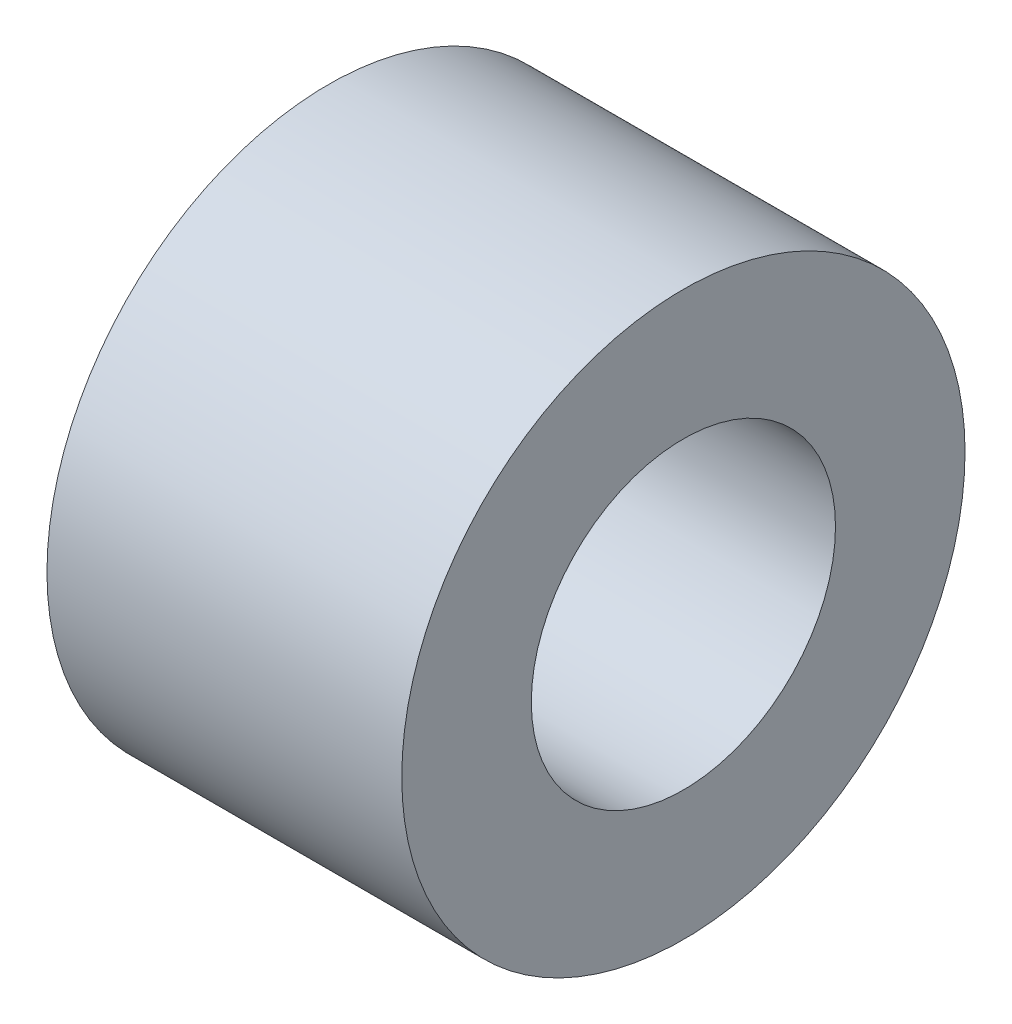
ISO-10303-21;
HEADER;
FILE_DESCRIPTION(('STEP AP214'),'2;1');
FILE_NAME('part.step','',(''),(''),'','','');
FILE_SCHEMA(('AUTOMOTIVE_DESIGN { 1 0 10303 214 1 1 1 1 }'));
ENDSEC;
DATA;
#1=APPLICATION_CONTEXT('core data for automotive mechanical design processes');
#2=APPLICATION_PROTOCOL_DEFINITION('international standard','automotive_design',2000,#1);
#3=PRODUCT_CONTEXT('',#1,'mechanical');
#4=PRODUCT('Part','Part','',(#3));
#5=PRODUCT_RELATED_PRODUCT_CATEGORY('part','',(#4));
#6=PRODUCT_DEFINITION_FORMATION('','',#4);
#7=PRODUCT_DEFINITION_CONTEXT('part definition',#1,'design');
#8=PRODUCT_DEFINITION('design','',#6,#7);
#9=PRODUCT_DEFINITION_SHAPE('','',#8);
#10=(LENGTH_UNIT() NAMED_UNIT(*) SI_UNIT(.MILLI.,.METRE.));
#11=(NAMED_UNIT(*) PLANE_ANGLE_UNIT() SI_UNIT($,.RADIAN.));
#12=(NAMED_UNIT(*) SI_UNIT($,.STERADIAN.) SOLID_ANGLE_UNIT());
#13=UNCERTAINTY_MEASURE_WITH_UNIT(LENGTH_MEASURE(1.E-05),#10,'distance_accuracy_value','');
#14=(GEOMETRIC_REPRESENTATION_CONTEXT(3) GLOBAL_UNCERTAINTY_ASSIGNED_CONTEXT((#13)) GLOBAL_UNIT_ASSIGNED_CONTEXT((#10,
#11,#12)) REPRESENTATION_CONTEXT('',''));
#15=CARTESIAN_POINT('',(0.,0.,0.));
#16=DIRECTION('',(0.,0.,1.));
#17=DIRECTION('',(1.,0.,0.));
#18=AXIS2_PLACEMENT_3D('',#15,#16,#17);
#19=CARTESIAN_POINT('',(-8.,0.,0.));
#20=DIRECTION('',(1.,0.,0.));
#21=DIRECTION('',(0.,0.,-1.));
#22=AXIS2_PLACEMENT_3D('',#19,#20,#21);
#23=CYLINDRICAL_SURFACE('',#22,6.35);
#24=CARTESIAN_POINT('',(-8.,0.,0.));
#25=DIRECTION('',(1.,0.,0.));
#26=DIRECTION('',(0.,0.,-1.));
#27=AXIS2_PLACEMENT_3D('',#24,#25,#26);
#28=CIRCLE('',#27,6.35);
#29=CARTESIAN_POINT('',(-8.,0.,-6.35));
#30=VERTEX_POINT('',#29);
#31=EDGE_CURVE('E10',#30,#30,#28,.T.);
#32=ORIENTED_EDGE('',*,*,#31,.T.);
#33=EDGE_LOOP('',(#32));
#34=FACE_BOUND('',#33,.T.);
#35=CARTESIAN_POINT('',(0.,0.,0.));
#36=DIRECTION('',(1.,0.,0.));
#37=DIRECTION('',(0.,0.,-1.));
#38=AXIS2_PLACEMENT_3D('',#35,#36,#37);
#39=CIRCLE('',#38,6.35);
#40=CARTESIAN_POINT('',(0.,0.,-6.35));
#41=VERTEX_POINT('',#40);
#42=EDGE_CURVE('E34',#41,#41,#39,.T.);
#43=ORIENTED_EDGE('',*,*,#42,.F.);
#44=EDGE_LOOP('',(#43));
#45=FACE_BOUND('',#44,.T.);
#46=ADVANCED_FACE('F31',(#34,#45),#23,.T.);
#47=CARTESIAN_POINT('',(-8.,0.,0.));
#48=DIRECTION('',(1.,0.,0.));
#49=DIRECTION('',(0.,0.,-1.));
#50=AXIS2_PLACEMENT_3D('',#47,#48,#49);
#51=PLANE('',#50);
#52=CARTESIAN_POINT('',(-8.,0.,0.));
#53=DIRECTION('',(1.,0.,0.));
#54=DIRECTION('',(0.,0.,-1.));
#55=AXIS2_PLACEMENT_3D('',#52,#53,#54);
#56=CIRCLE('',#55,3.429);
#57=CARTESIAN_POINT('',(-8.,0.,-3.429));
#58=VERTEX_POINT('',#57);
#59=EDGE_CURVE('E41',#58,#58,#56,.T.);
#60=ORIENTED_EDGE('',*,*,#59,.T.);
#61=EDGE_LOOP('',(#60));
#62=FACE_BOUND('',#61,.T.);
#63=ORIENTED_EDGE('',*,*,#31,.F.);
#64=EDGE_LOOP('',(#63));
#65=FACE_BOUND('',#64,.T.);
#66=ADVANCED_FACE('F49',(#62,#65),#51,.F.);
#67=CARTESIAN_POINT('',(0.,0.,0.));
#68=DIRECTION('',(1.,0.,0.));
#69=DIRECTION('',(0.,0.,-1.));
#70=AXIS2_PLACEMENT_3D('',#67,#68,#69);
#71=PLANE('',#70);
#72=CARTESIAN_POINT('',(0.,0.,0.));
#73=DIRECTION('',(1.,0.,0.));
#74=DIRECTION('',(0.,0.,-1.));
#75=AXIS2_PLACEMENT_3D('',#72,#73,#74);
#76=CIRCLE('',#75,3.429);
#77=CARTESIAN_POINT('',(0.,0.,-3.429));
#78=VERTEX_POINT('',#77);
#79=EDGE_CURVE('E43',#78,#78,#76,.T.);
#80=ORIENTED_EDGE('',*,*,#79,.F.);
#81=EDGE_LOOP('',(#80));
#82=FACE_BOUND('',#81,.T.);
#83=ORIENTED_EDGE('',*,*,#42,.T.);
#84=EDGE_LOOP('',(#83));
#85=FACE_BOUND('',#84,.T.);
#86=ADVANCED_FACE('F55',(#82,#85),#71,.T.);
#87=CARTESIAN_POINT('',(-8.,0.,0.));
#88=DIRECTION('',(1.,0.,0.));
#89=DIRECTION('',(0.,0.,-1.));
#90=AXIS2_PLACEMENT_3D('',#87,#88,#89);
#91=CYLINDRICAL_SURFACE('',#90,3.429);
#92=ORIENTED_EDGE('',*,*,#59,.F.);
#93=EDGE_LOOP('',(#92));
#94=FACE_BOUND('',#93,.T.);
#95=ORIENTED_EDGE('',*,*,#79,.T.);
#96=EDGE_LOOP('',(#95));
#97=FACE_BOUND('',#96,.T.);
#98=ADVANCED_FACE('F52',(#94,#97),#91,.F.);
#99=CLOSED_SHELL('',(#46,#66,#86,#98));
#100=MANIFOLD_SOLID_BREP('B2',#99);
#101=ADVANCED_BREP_SHAPE_REPRESENTATION('',(#18,#100),#14);
#102=SHAPE_DEFINITION_REPRESENTATION(#9,#101);
ENDSEC;
END-ISO-10303-21;
